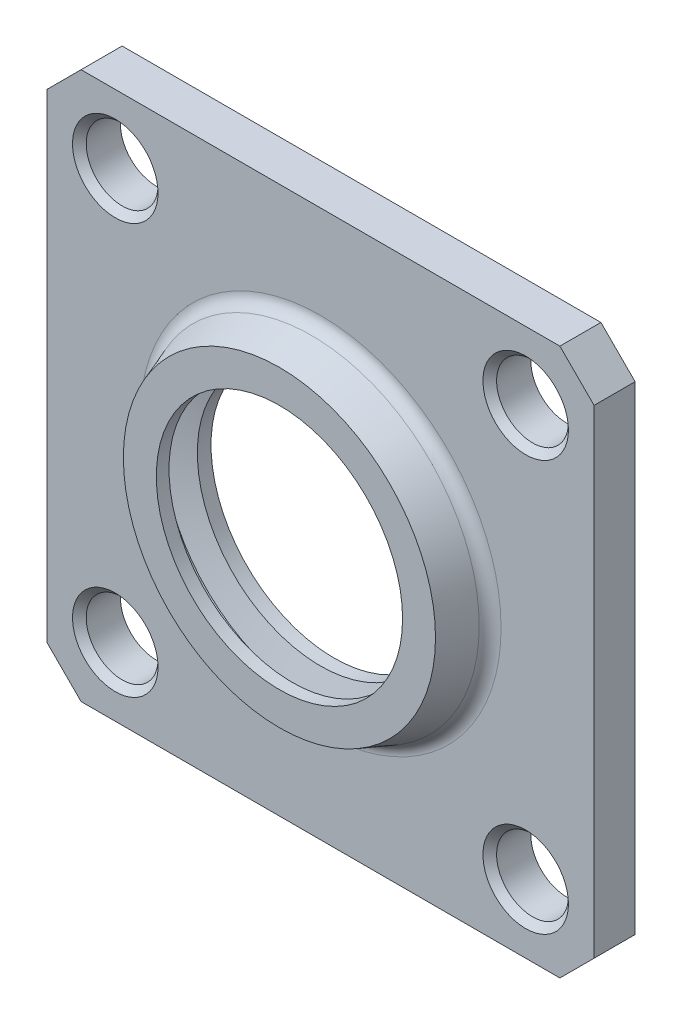
ISO-10303-21;
HEADER;
FILE_DESCRIPTION(('STEP AP214'),'2;1');
FILE_NAME('part.step','',(''),(''),'','','');
FILE_SCHEMA(('AUTOMOTIVE_DESIGN { 1 0 10303 214 1 1 1 1 }'));
ENDSEC;
DATA;
#1=APPLICATION_CONTEXT('core data for automotive mechanical design processes');
#2=APPLICATION_PROTOCOL_DEFINITION('international standard','automotive_design',2000,#1);
#3=PRODUCT_CONTEXT('',#1,'mechanical');
#4=PRODUCT('Part','Part','',(#3));
#5=PRODUCT_RELATED_PRODUCT_CATEGORY('part','',(#4));
#6=PRODUCT_DEFINITION_FORMATION('','',#4);
#7=PRODUCT_DEFINITION_CONTEXT('part definition',#1,'design');
#8=PRODUCT_DEFINITION('design','',#6,#7);
#9=PRODUCT_DEFINITION_SHAPE('','',#8);
#10=(LENGTH_UNIT() NAMED_UNIT(*) SI_UNIT(.MILLI.,.METRE.));
#11=(NAMED_UNIT(*) PLANE_ANGLE_UNIT() SI_UNIT($,.RADIAN.));
#12=(NAMED_UNIT(*) SI_UNIT($,.STERADIAN.) SOLID_ANGLE_UNIT());
#13=UNCERTAINTY_MEASURE_WITH_UNIT(LENGTH_MEASURE(1.E-05),#10,'distance_accuracy_value','');
#14=(GEOMETRIC_REPRESENTATION_CONTEXT(3) GLOBAL_UNCERTAINTY_ASSIGNED_CONTEXT((#13)) GLOBAL_UNIT_ASSIGNED_CONTEXT((#10,
#11,#12)) REPRESENTATION_CONTEXT('',''));
#15=CARTESIAN_POINT('',(0.,0.,0.));
#16=DIRECTION('',(0.,0.,1.));
#17=DIRECTION('',(1.,0.,0.));
#18=AXIS2_PLACEMENT_3D('',#15,#16,#17);
#19=CARTESIAN_POINT('',(-30.,-30.,0.959883800153095));
#20=DIRECTION('',(0.,-1.,0.));
#21=DIRECTION('',(0.,0.,-1.));
#22=AXIS2_PLACEMENT_3D('',#19,#20,#21);
#23=PLANE('',#22);
#24=DIRECTION('',(1.,0.,0.));
#25=VECTOR('',#24,1.);
#26=CARTESIAN_POINT('',(-30.,-30.,0.959883800153095));
#27=LINE('',#26,#25);
#28=CARTESIAN_POINT('',(-26.25,-30.,0.959883800153095));
#29=VERTEX_POINT('',#28);
#30=CARTESIAN_POINT('',(26.25,-30.,0.959883800153095));
#31=VERTEX_POINT('',#30);
#32=EDGE_CURVE('E300',#29,#31,#27,.T.);
#33=ORIENTED_EDGE('',*,*,#32,.T.);
#34=DIRECTION('',(0.,0.,1.));
#35=VECTOR('',#34,1.);
#36=CARTESIAN_POINT('',(26.25,-30.,0.959883800153095));
#37=LINE('',#36,#35);
#38=CARTESIAN_POINT('',(26.25,-30.,5.4598838001531));
#39=VERTEX_POINT('',#38);
#40=EDGE_CURVE('E120',#31,#39,#37,.T.);
#41=ORIENTED_EDGE('',*,*,#40,.T.);
#42=DIRECTION('',(1.,0.,0.));
#43=VECTOR('',#42,1.);
#44=CARTESIAN_POINT('',(-30.,-30.,5.4598838001531));
#45=LINE('',#44,#43);
#46=CARTESIAN_POINT('',(-26.25,-30.,5.4598838001531));
#47=VERTEX_POINT('',#46);
#48=EDGE_CURVE('E104',#47,#39,#45,.T.);
#49=ORIENTED_EDGE('',*,*,#48,.F.);
#50=DIRECTION('',(0.,0.,-1.));
#51=VECTOR('',#50,1.);
#52=CARTESIAN_POINT('',(-26.25,-30.,0.959883800153095));
#53=LINE('',#52,#51);
#54=EDGE_CURVE('E117',#47,#29,#53,.T.);
#55=ORIENTED_EDGE('',*,*,#54,.T.);
#56=EDGE_LOOP('',(#33,#41,#49,#55));
#57=FACE_BOUND('',#56,.T.);
#58=ADVANCED_FACE('F34',(#57),#23,.T.);
#59=CARTESIAN_POINT('',(-30.,30.,0.959883800153095));
#60=DIRECTION('',(-1.,0.,0.));
#61=DIRECTION('',(0.,0.,1.));
#62=AXIS2_PLACEMENT_3D('',#59,#60,#61);
#63=PLANE('',#62);
#64=DIRECTION('',(0.,-1.,0.));
#65=VECTOR('',#64,1.);
#66=CARTESIAN_POINT('',(-30.,30.,0.959883800153095));
#67=LINE('',#66,#65);
#68=CARTESIAN_POINT('',(-30.,26.25,0.959883800153095));
#69=VERTEX_POINT('',#68);
#70=CARTESIAN_POINT('',(-30.,-26.25,0.959883800153095));
#71=VERTEX_POINT('',#70);
#72=EDGE_CURVE('E127',#69,#71,#67,.T.);
#73=ORIENTED_EDGE('',*,*,#72,.T.);
#74=DIRECTION('',(0.,0.,1.));
#75=VECTOR('',#74,1.);
#76=CARTESIAN_POINT('',(-30.,-26.25,0.959883800153095));
#77=LINE('',#76,#75);
#78=CARTESIAN_POINT('',(-30.,-26.25,5.4598838001531));
#79=VERTEX_POINT('',#78);
#80=EDGE_CURVE('E153',#71,#79,#77,.T.);
#81=ORIENTED_EDGE('',*,*,#80,.T.);
#82=DIRECTION('',(0.,-1.,0.));
#83=VECTOR('',#82,1.);
#84=CARTESIAN_POINT('',(-30.,30.,5.4598838001531));
#85=LINE('',#84,#83);
#86=CARTESIAN_POINT('',(-30.,26.25,5.4598838001531));
#87=VERTEX_POINT('',#86);
#88=EDGE_CURVE('E106',#87,#79,#85,.T.);
#89=ORIENTED_EDGE('',*,*,#88,.F.);
#90=DIRECTION('',(0.,0.,-1.));
#91=VECTOR('',#90,1.);
#92=CARTESIAN_POINT('',(-30.,26.25,0.959883800153095));
#93=LINE('',#92,#91);
#94=EDGE_CURVE('E151',#87,#69,#93,.T.);
#95=ORIENTED_EDGE('',*,*,#94,.T.);
#96=EDGE_LOOP('',(#73,#81,#89,#95));
#97=FACE_BOUND('',#96,.T.);
#98=ADVANCED_FACE('F210',(#97),#63,.T.);
#99=CARTESIAN_POINT('',(30.,30.,0.959883800153095));
#100=DIRECTION('',(0.,1.,0.));
#101=DIRECTION('',(0.,0.,1.));
#102=AXIS2_PLACEMENT_3D('',#99,#100,#101);
#103=PLANE('',#102);
#104=DIRECTION('',(-1.,0.,0.));
#105=VECTOR('',#104,1.);
#106=CARTESIAN_POINT('',(30.,30.,5.4598838001531));
#107=LINE('',#106,#105);
#108=CARTESIAN_POINT('',(26.25,30.,5.4598838001531));
#109=VERTEX_POINT('',#108);
#110=CARTESIAN_POINT('',(-26.25,30.,5.4598838001531));
#111=VERTEX_POINT('',#110);
#112=EDGE_CURVE('E307',#109,#111,#107,.T.);
#113=ORIENTED_EDGE('',*,*,#112,.F.);
#114=DIRECTION('',(0.,0.,-1.));
#115=VECTOR('',#114,1.);
#116=CARTESIAN_POINT('',(26.25,30.,0.959883800153095));
#117=LINE('',#116,#115);
#118=CARTESIAN_POINT('',(26.25,30.,0.959883800153095));
#119=VERTEX_POINT('',#118);
#120=EDGE_CURVE('E56',#109,#119,#117,.T.);
#121=ORIENTED_EDGE('',*,*,#120,.T.);
#122=DIRECTION('',(-1.,0.,0.));
#123=VECTOR('',#122,1.);
#124=CARTESIAN_POINT('',(30.,30.,0.959883800153095));
#125=LINE('',#124,#123);
#126=CARTESIAN_POINT('',(-26.25,30.,0.959883800153095));
#127=VERTEX_POINT('',#126);
#128=EDGE_CURVE('E132',#119,#127,#125,.T.);
#129=ORIENTED_EDGE('',*,*,#128,.T.);
#130=DIRECTION('',(0.,0.,1.));
#131=VECTOR('',#130,1.);
#132=CARTESIAN_POINT('',(-26.25,30.,0.959883800153095));
#133=LINE('',#132,#131);
#134=EDGE_CURVE('E155',#127,#111,#133,.T.);
#135=ORIENTED_EDGE('',*,*,#134,.T.);
#136=EDGE_LOOP('',(#113,#121,#129,#135));
#137=FACE_BOUND('',#136,.T.);
#138=ADVANCED_FACE('F215',(#137),#103,.T.);
#139=CARTESIAN_POINT('',(30.,-30.,0.959883800153095));
#140=DIRECTION('',(1.,0.,0.));
#141=DIRECTION('',(0.,0.,-1.));
#142=AXIS2_PLACEMENT_3D('',#139,#140,#141);
#143=PLANE('',#142);
#144=DIRECTION('',(0.,1.,0.));
#145=VECTOR('',#144,1.);
#146=CARTESIAN_POINT('',(30.,-30.,5.4598838001531));
#147=LINE('',#146,#145);
#148=CARTESIAN_POINT('',(30.,-26.25,5.4598838001531));
#149=VERTEX_POINT('',#148);
#150=CARTESIAN_POINT('',(30.,26.25,5.4598838001531));
#151=VERTEX_POINT('',#150);
#152=EDGE_CURVE('E121',#149,#151,#147,.T.);
#153=ORIENTED_EDGE('',*,*,#152,.F.);
#154=DIRECTION('',(0.,0.,-1.));
#155=VECTOR('',#154,1.);
#156=CARTESIAN_POINT('',(30.,-26.25,0.959883800153095));
#157=LINE('',#156,#155);
#158=CARTESIAN_POINT('',(30.,-26.25,0.959883800153095));
#159=VERTEX_POINT('',#158);
#160=EDGE_CURVE('E143',#149,#159,#157,.T.);
#161=ORIENTED_EDGE('',*,*,#160,.T.);
#162=DIRECTION('',(0.,1.,0.));
#163=VECTOR('',#162,1.);
#164=CARTESIAN_POINT('',(30.,-30.,0.959883800153095));
#165=LINE('',#164,#163);
#166=CARTESIAN_POINT('',(30.,26.25,0.959883800153095));
#167=VERTEX_POINT('',#166);
#168=EDGE_CURVE('E302',#159,#167,#165,.T.);
#169=ORIENTED_EDGE('',*,*,#168,.T.);
#170=DIRECTION('',(0.,0.,1.));
#171=VECTOR('',#170,1.);
#172=CARTESIAN_POINT('',(30.,26.25,0.959883800153095));
#173=LINE('',#172,#171);
#174=EDGE_CURVE('E140',#167,#151,#173,.T.);
#175=ORIENTED_EDGE('',*,*,#174,.T.);
#176=EDGE_LOOP('',(#153,#161,#169,#175));
#177=FACE_BOUND('',#176,.T.);
#178=ADVANCED_FACE('F220',(#177),#143,.T.);
#179=CARTESIAN_POINT('',(0.,0.,0.959883800153095));
#180=DIRECTION('',(0.,0.,1.));
#181=DIRECTION('',(1.,0.,0.));
#182=AXIS2_PLACEMENT_3D('',#179,#180,#181);
#183=PLANE('',#182);
#184=CARTESIAN_POINT('',(0.,0.,0.959883800153095));
#185=DIRECTION('',(0.,0.,1.));
#186=DIRECTION('',(1.,0.,0.));
#187=AXIS2_PLACEMENT_3D('',#184,#185,#186);
#188=CIRCLE('',#187,20.2500000000295);
#189=CARTESIAN_POINT('',(20.2500000000295,0.,0.959883800153095));
#190=VERTEX_POINT('',#189);
#191=EDGE_CURVE('E177',#190,#190,#188,.T.);
#192=ORIENTED_EDGE('',*,*,#191,.T.);
#193=EDGE_LOOP('',(#192));
#194=FACE_BOUND('',#193,.T.);
#195=CARTESIAN_POINT('',(22.5,22.5,0.959883800153092));
#196=DIRECTION('',(0.,0.,1.));
#197=DIRECTION('',(1.,0.,0.));
#198=AXIS2_PLACEMENT_3D('',#195,#196,#197);
#199=CIRCLE('',#198,3.93749999999999);
#200=CARTESIAN_POINT('',(26.4375,22.5,0.959883800153092));
#201=VERTEX_POINT('',#200);
#202=EDGE_CURVE('E267',#201,#201,#199,.T.);
#203=ORIENTED_EDGE('',*,*,#202,.T.);
#204=EDGE_LOOP('',(#203));
#205=FACE_BOUND('',#204,.T.);
#206=CARTESIAN_POINT('',(-22.5,22.5,0.959883800153092));
#207=DIRECTION('',(0.,0.,1.));
#208=DIRECTION('',(1.,0.,0.));
#209=AXIS2_PLACEMENT_3D('',#206,#207,#208);
#210=CIRCLE('',#209,3.93749999999999);
#211=CARTESIAN_POINT('',(-18.5625,22.5,0.959883800153092));
#212=VERTEX_POINT('',#211);
#213=EDGE_CURVE('E269',#212,#212,#210,.T.);
#214=ORIENTED_EDGE('',*,*,#213,.T.);
#215=EDGE_LOOP('',(#214));
#216=FACE_BOUND('',#215,.T.);
#217=CARTESIAN_POINT('',(-22.5,-22.5,0.959883800153092));
#218=DIRECTION('',(0.,0.,1.));
#219=DIRECTION('',(1.,0.,0.));
#220=AXIS2_PLACEMENT_3D('',#217,#218,#219);
#221=CIRCLE('',#220,3.93749999999999);
#222=CARTESIAN_POINT('',(-18.5625,-22.5,0.959883800153092));
#223=VERTEX_POINT('',#222);
#224=EDGE_CURVE('E272',#223,#223,#221,.T.);
#225=ORIENTED_EDGE('',*,*,#224,.T.);
#226=EDGE_LOOP('',(#225));
#227=FACE_BOUND('',#226,.T.);
#228=CARTESIAN_POINT('',(22.5,-22.5,0.959883800153092));
#229=DIRECTION('',(0.,0.,1.));
#230=DIRECTION('',(1.,0.,0.));
#231=AXIS2_PLACEMENT_3D('',#228,#229,#230);
#232=CIRCLE('',#231,3.93749999999999);
#233=CARTESIAN_POINT('',(26.4375,-22.5,0.959883800153092));
#234=VERTEX_POINT('',#233);
#235=EDGE_CURVE('E277',#234,#234,#232,.T.);
#236=ORIENTED_EDGE('',*,*,#235,.T.);
#237=EDGE_LOOP('',(#236));
#238=FACE_BOUND('',#237,.T.);
#239=ORIENTED_EDGE('',*,*,#168,.F.);
#240=DIRECTION('',(0.707106781186546,0.707106781186549,0.));
#241=VECTOR('',#240,1.);
#242=CARTESIAN_POINT('',(26.25,-30.,0.959883800153095));
#243=LINE('',#242,#241);
#244=EDGE_CURVE('E149',#159,#31,#243,.F.);
#245=ORIENTED_EDGE('',*,*,#244,.T.);
#246=ORIENTED_EDGE('',*,*,#32,.F.);
#247=DIRECTION('',(0.707106781186549,-0.707106781186546,0.));
#248=VECTOR('',#247,1.);
#249=CARTESIAN_POINT('',(-30.,-26.25,0.959883800153095));
#250=LINE('',#249,#248);
#251=EDGE_CURVE('E126',#29,#71,#250,.F.);
#252=ORIENTED_EDGE('',*,*,#251,.T.);
#253=ORIENTED_EDGE('',*,*,#72,.F.);
#254=DIRECTION('',(-0.707106781186546,-0.707106781186549,0.));
#255=VECTOR('',#254,1.);
#256=CARTESIAN_POINT('',(-26.25,30.,0.959883800153095));
#257=LINE('',#256,#255);
#258=EDGE_CURVE('E49',#69,#127,#257,.F.);
#259=ORIENTED_EDGE('',*,*,#258,.T.);
#260=ORIENTED_EDGE('',*,*,#128,.F.);
#261=DIRECTION('',(-0.707106781186549,0.707106781186546,0.));
#262=VECTOR('',#261,1.);
#263=CARTESIAN_POINT('',(30.,26.25,0.959883800153095));
#264=LINE('',#263,#262);
#265=EDGE_CURVE('E146',#119,#167,#264,.F.);
#266=ORIENTED_EDGE('',*,*,#265,.T.);
#267=EDGE_LOOP('',(#239,#245,#246,#252,#253,#259,#260,#266));
#268=FACE_BOUND('',#267,.T.);
#269=ADVANCED_FACE('F313',(#194,#205,#216,#227,#238,#268),#183,.F.);
#270=CARTESIAN_POINT('',(0.,0.,5.4598838001531));
#271=DIRECTION('',(0.,0.,1.));
#272=DIRECTION('',(1.,0.,0.));
#273=AXIS2_PLACEMENT_3D('',#270,#271,#272);
#274=PLANE('',#273);
#275=CARTESIAN_POINT('',(0.,0.,5.4598838001531));
#276=DIRECTION('',(0.,0.,1.));
#277=DIRECTION('',(1.,0.,0.));
#278=AXIS2_PLACEMENT_3D('',#275,#276,#277);
#279=CIRCLE('',#278,19.8003113073173);
#280=CARTESIAN_POINT('',(19.8003113073173,0.,5.4598838001531));
#281=VERTEX_POINT('',#280);
#282=EDGE_CURVE('E11',#281,#281,#279,.F.);
#283=ORIENTED_EDGE('',*,*,#282,.T.);
#284=EDGE_LOOP('',(#283));
#285=FACE_BOUND('',#284,.T.);
#286=CARTESIAN_POINT('',(-22.5,-22.5,5.4598838001531));
#287=DIRECTION('',(0.,0.,1.));
#288=DIRECTION('',(1.,0.,0.));
#289=AXIS2_PLACEMENT_3D('',#286,#287,#288);
#290=CIRCLE('',#289,4.6875000000295);
#291=CARTESIAN_POINT('',(-17.8124999999705,-22.5,5.4598838001531));
#292=VERTEX_POINT('',#291);
#293=EDGE_CURVE('E171',#292,#292,#290,.F.);
#294=ORIENTED_EDGE('',*,*,#293,.T.);
#295=EDGE_LOOP('',(#294));
#296=FACE_BOUND('',#295,.T.);
#297=CARTESIAN_POINT('',(22.5,-22.5,5.4598838001531));
#298=DIRECTION('',(0.,0.,1.));
#299=DIRECTION('',(1.,0.,0.));
#300=AXIS2_PLACEMENT_3D('',#297,#298,#299);
#301=CIRCLE('',#300,4.6875000000295);
#302=CARTESIAN_POINT('',(27.1875000000295,-22.5,5.4598838001531));
#303=VERTEX_POINT('',#302);
#304=EDGE_CURVE('E168',#303,#303,#301,.F.);
#305=ORIENTED_EDGE('',*,*,#304,.T.);
#306=EDGE_LOOP('',(#305));
#307=FACE_BOUND('',#306,.T.);
#308=CARTESIAN_POINT('',(-22.5,22.5,5.4598838001531));
#309=DIRECTION('',(0.,0.,1.));
#310=DIRECTION('',(1.,0.,0.));
#311=AXIS2_PLACEMENT_3D('',#308,#309,#310);
#312=CIRCLE('',#311,4.6875000000295);
#313=CARTESIAN_POINT('',(-17.8124999999705,22.5,5.4598838001531));
#314=VERTEX_POINT('',#313);
#315=EDGE_CURVE('E165',#314,#314,#312,.F.);
#316=ORIENTED_EDGE('',*,*,#315,.T.);
#317=EDGE_LOOP('',(#316));
#318=FACE_BOUND('',#317,.T.);
#319=CARTESIAN_POINT('',(22.5,22.5,5.4598838001531));
#320=DIRECTION('',(0.,0.,1.));
#321=DIRECTION('',(1.,0.,0.));
#322=AXIS2_PLACEMENT_3D('',#319,#320,#321);
#323=CIRCLE('',#322,4.6875000000295);
#324=CARTESIAN_POINT('',(27.1875000000295,22.5,5.4598838001531));
#325=VERTEX_POINT('',#324);
#326=EDGE_CURVE('E162',#325,#325,#323,.F.);
#327=ORIENTED_EDGE('',*,*,#326,.T.);
#328=EDGE_LOOP('',(#327));
#329=FACE_BOUND('',#328,.T.);
#330=ORIENTED_EDGE('',*,*,#48,.T.);
#331=DIRECTION('',(-0.707106781186546,-0.707106781186549,0.));
#332=VECTOR('',#331,1.);
#333=CARTESIAN_POINT('',(28.1250000000001,-28.1249999999999,5.4598838001531));
#334=LINE('',#333,#332);
#335=EDGE_CURVE('E111',#39,#149,#334,.F.);
#336=ORIENTED_EDGE('',*,*,#335,.T.);
#337=ORIENTED_EDGE('',*,*,#152,.T.);
#338=DIRECTION('',(0.707106781186549,-0.707106781186546,0.));
#339=VECTOR('',#338,1.);
#340=CARTESIAN_POINT('',(28.1249999999999,28.1250000000001,5.4598838001531));
#341=LINE('',#340,#339);
#342=EDGE_CURVE('E112',#151,#109,#341,.F.);
#343=ORIENTED_EDGE('',*,*,#342,.T.);
#344=ORIENTED_EDGE('',*,*,#112,.T.);
#345=DIRECTION('',(0.707106781186546,0.707106781186549,0.));
#346=VECTOR('',#345,1.);
#347=CARTESIAN_POINT('',(-28.1250000000001,28.1249999999999,5.4598838001531));
#348=LINE('',#347,#346);
#349=EDGE_CURVE('E129',#111,#87,#348,.F.);
#350=ORIENTED_EDGE('',*,*,#349,.T.);
#351=ORIENTED_EDGE('',*,*,#88,.T.);
#352=DIRECTION('',(-0.707106781186549,0.707106781186546,0.));
#353=VECTOR('',#352,1.);
#354=CARTESIAN_POINT('',(-28.1249999999999,-28.1250000000001,5.4598838001531));
#355=LINE('',#354,#353);
#356=EDGE_CURVE('E101',#79,#47,#355,.F.);
#357=ORIENTED_EDGE('',*,*,#356,.T.);
#358=EDGE_LOOP('',(#330,#336,#337,#343,#344,#350,#351,#357));
#359=FACE_BOUND('',#358,.T.);
#360=ADVANCED_FACE('F103',(#285,#296,#307,#318,#329,#359),#274,.T.);
#361=CARTESIAN_POINT('',(0.,0.,9.9598838001531));
#362=DIRECTION('',(0.,0.,-1.));
#363=DIRECTION('',(-1.,0.,0.));
#364=AXIS2_PLACEMENT_3D('',#361,#362,#363);
#365=CONICAL_SURFACE('',#364,17.1121339458051,0.3490658503988);
#366=CARTESIAN_POINT('',(0.,0.,6.44685358516469));
#367=DIRECTION('',(0.,0.,-1.));
#368=DIRECTION('',(-1.,0.,0.));
#369=AXIS2_PLACEMENT_3D('',#366,#367,#368);
#370=CIRCLE('',#369,18.3907723761384);
#371=CARTESIAN_POINT('',(-18.3907723761384,0.,6.44685358516469));
#372=VERTEX_POINT('',#371);
#373=EDGE_CURVE('E42',#372,#372,#370,.F.);
#374=ORIENTED_EDGE('',*,*,#373,.T.);
#375=EDGE_LOOP('',(#374));
#376=FACE_BOUND('',#375,.T.);
#377=CARTESIAN_POINT('',(0.,0.,9.9598838001531));
#378=DIRECTION('',(0.,0.,1.));
#379=DIRECTION('',(1.,0.,0.));
#380=AXIS2_PLACEMENT_3D('',#377,#378,#379);
#381=CIRCLE('',#380,17.1121339458051);
#382=CARTESIAN_POINT('',(17.1121339458051,0.,9.9598838001531));
#383=VERTEX_POINT('',#382);
#384=EDGE_CURVE('E122',#383,#383,#381,.T.);
#385=ORIENTED_EDGE('',*,*,#384,.F.);
#386=EDGE_LOOP('',(#385));
#387=FACE_BOUND('',#386,.T.);
#388=ADVANCED_FACE('F197',(#376,#387),#365,.T.);
#389=CARTESIAN_POINT('',(0.,0.,9.9598838001531));
#390=DIRECTION('',(0.,0.,1.));
#391=DIRECTION('',(1.,0.,0.));
#392=AXIS2_PLACEMENT_3D('',#389,#390,#391);
#393=PLANE('',#392);
#394=CARTESIAN_POINT('',(0.,0.,9.9598838001531));
#395=DIRECTION('',(0.,0.,1.));
#396=DIRECTION('',(1.,0.,0.));
#397=AXIS2_PLACEMENT_3D('',#394,#395,#396);
#398=CIRCLE('',#397,13.5);
#399=CARTESIAN_POINT('',(13.5,0.,9.9598838001531));
#400=VERTEX_POINT('',#399);
#401=EDGE_CURVE('E295',#400,#400,#398,.T.);
#402=ORIENTED_EDGE('',*,*,#401,.F.);
#403=EDGE_LOOP('',(#402));
#404=FACE_BOUND('',#403,.T.);
#405=ORIENTED_EDGE('',*,*,#384,.T.);
#406=EDGE_LOOP('',(#405));
#407=FACE_BOUND('',#406,.T.);
#408=ADVANCED_FACE('F334',(#404,#407),#393,.T.);
#409=CARTESIAN_POINT('',(0.,0.,0.959883800153095));
#410=DIRECTION('',(0.,0.,1.));
#411=DIRECTION('',(1.,0.,0.));
#412=AXIS2_PLACEMENT_3D('',#409,#410,#411);
#413=CYLINDRICAL_SURFACE('',#412,19.5);
#414=CARTESIAN_POINT('',(0.,0.,3.20988380015309));
#415=DIRECTION('',(0.,0.,1.));
#416=DIRECTION('',(1.,0.,0.));
#417=AXIS2_PLACEMENT_3D('',#414,#415,#416);
#418=CIRCLE('',#417,19.5);
#419=CARTESIAN_POINT('',(19.5,0.,3.20988380015309));
#420=VERTEX_POINT('',#419);
#421=EDGE_CURVE('E189',#420,#420,#418,.T.);
#422=ORIENTED_EDGE('',*,*,#421,.T.);
#423=EDGE_LOOP('',(#422));
#424=FACE_BOUND('',#423,.T.);
#425=CARTESIAN_POINT('',(0.,0.,1.70988380018259));
#426=DIRECTION('',(0.,0.,1.));
#427=DIRECTION('',(1.,0.,0.));
#428=AXIS2_PLACEMENT_3D('',#425,#426,#427);
#429=CIRCLE('',#428,19.5);
#430=CARTESIAN_POINT('',(19.5,0.,1.70988380018259));
#431=VERTEX_POINT('',#430);
#432=EDGE_CURVE('E180',#431,#431,#429,.F.);
#433=ORIENTED_EDGE('',*,*,#432,.T.);
#434=EDGE_LOOP('',(#433));
#435=FACE_BOUND('',#434,.T.);
#436=ADVANCED_FACE('F337',(#424,#435),#413,.F.);
#437=CARTESIAN_POINT('',(0.,0.,0.959883800153095));
#438=DIRECTION('',(0.,0.,1.));
#439=DIRECTION('',(1.,0.,0.));
#440=AXIS2_PLACEMENT_3D('',#437,#438,#439);
#441=CYLINDRICAL_SURFACE('',#440,13.5);
#442=CARTESIAN_POINT('',(0.,0.,8.56757895474059));
#443=DIRECTION('',(0.,0.,1.));
#444=DIRECTION('',(1.,0.,0.));
#445=AXIS2_PLACEMENT_3D('',#442,#443,#444);
#446=CIRCLE('',#445,13.5);
#447=CARTESIAN_POINT('',(13.5,0.,8.56757895474059));
#448=VERTEX_POINT('',#447);
#449=EDGE_CURVE('E292',#448,#448,#446,.T.);
#450=ORIENTED_EDGE('',*,*,#449,.F.);
#451=EDGE_LOOP('',(#450));
#452=FACE_BOUND('',#451,.T.);
#453=ORIENTED_EDGE('',*,*,#401,.T.);
#454=EDGE_LOOP('',(#453));
#455=FACE_BOUND('',#454,.T.);
#456=ADVANCED_FACE('F341',(#452,#455),#441,.F.);
#457=CARTESIAN_POINT('',(0.,0.,8.56757895474059));
#458=DIRECTION('',(0.,0.,-1.));
#459=DIRECTION('',(-1.,0.,0.));
#460=AXIS2_PLACEMENT_3D('',#457,#458,#459);
#461=CONICAL_SURFACE('',#460,13.5,1.30899693899545);
#462=CARTESIAN_POINT('',(0.,0.,7.76373137744627));
#463=DIRECTION('',(0.,0.,1.));
#464=DIRECTION('',(1.,0.,0.));
#465=AXIS2_PLACEMENT_3D('',#462,#463,#464);
#466=CIRCLE('',#465,16.5);
#467=CARTESIAN_POINT('',(16.5,0.,7.76373137744627));
#468=VERTEX_POINT('',#467);
#469=EDGE_CURVE('E289',#468,#468,#466,.T.);
#470=ORIENTED_EDGE('',*,*,#469,.F.);
#471=EDGE_LOOP('',(#470));
#472=FACE_BOUND('',#471,.T.);
#473=ORIENTED_EDGE('',*,*,#449,.T.);
#474=EDGE_LOOP('',(#473));
#475=FACE_BOUND('',#474,.T.);
#476=ADVANCED_FACE('F345',(#472,#475),#461,.F.);
#477=CARTESIAN_POINT('',(0.,0.,0.959883800153095));
#478=DIRECTION('',(0.,0.,1.));
#479=DIRECTION('',(1.,0.,0.));
#480=AXIS2_PLACEMENT_3D('',#477,#478,#479);
#481=CYLINDRICAL_SURFACE('',#480,16.5);
#482=CARTESIAN_POINT('',(0.,0.,6.26373137744664));
#483=DIRECTION('',(0.,0.,1.));
#484=DIRECTION('',(1.,0.,0.));
#485=AXIS2_PLACEMENT_3D('',#482,#483,#484);
#486=CIRCLE('',#485,16.5);
#487=CARTESIAN_POINT('',(16.5,0.,6.26373137744664));
#488=VERTEX_POINT('',#487);
#489=EDGE_CURVE('E286',#488,#488,#486,.T.);
#490=ORIENTED_EDGE('',*,*,#489,.F.);
#491=EDGE_LOOP('',(#490));
#492=FACE_BOUND('',#491,.T.);
#493=ORIENTED_EDGE('',*,*,#469,.T.);
#494=EDGE_LOOP('',(#493));
#495=FACE_BOUND('',#494,.T.);
#496=ADVANCED_FACE('F349',(#492,#495),#481,.F.);
#497=CARTESIAN_POINT('',(0.,0.,6.26373137744664));
#498=DIRECTION('',(0.,0.,1.));
#499=DIRECTION('',(1.,0.,0.));
#500=AXIS2_PLACEMENT_3D('',#497,#498,#499);
#501=CONICAL_SURFACE('',#500,16.5,1.30899693899569);
#502=CARTESIAN_POINT('',(0.,0.,5.4598838001531));
#503=DIRECTION('',(0.,0.,1.));
#504=DIRECTION('',(1.,0.,0.));
#505=AXIS2_PLACEMENT_3D('',#502,#503,#504);
#506=CIRCLE('',#505,13.5);
#507=CARTESIAN_POINT('',(13.5,0.,5.4598838001531));
#508=VERTEX_POINT('',#507);
#509=EDGE_CURVE('E283',#508,#508,#506,.T.);
#510=ORIENTED_EDGE('',*,*,#509,.F.);
#511=EDGE_LOOP('',(#510));
#512=FACE_BOUND('',#511,.T.);
#513=ORIENTED_EDGE('',*,*,#489,.T.);
#514=EDGE_LOOP('',(#513));
#515=FACE_BOUND('',#514,.T.);
#516=ADVANCED_FACE('F353',(#512,#515),#501,.F.);
#517=CARTESIAN_POINT('',(0.,0.,0.959883800153095));
#518=DIRECTION('',(0.,0.,1.));
#519=DIRECTION('',(1.,0.,0.));
#520=AXIS2_PLACEMENT_3D('',#517,#518,#519);
#521=CYLINDRICAL_SURFACE('',#520,13.5);
#522=CARTESIAN_POINT('',(0.,0.,3.9598838001531));
#523=DIRECTION('',(0.,0.,1.));
#524=DIRECTION('',(1.,0.,0.));
#525=AXIS2_PLACEMENT_3D('',#522,#523,#524);
#526=CIRCLE('',#525,13.5);
#527=CARTESIAN_POINT('',(13.5,0.,3.9598838001531));
#528=VERTEX_POINT('',#527);
#529=EDGE_CURVE('E280',#528,#528,#526,.T.);
#530=ORIENTED_EDGE('',*,*,#529,.F.);
#531=EDGE_LOOP('',(#530));
#532=FACE_BOUND('',#531,.T.);
#533=ORIENTED_EDGE('',*,*,#509,.T.);
#534=EDGE_LOOP('',(#533));
#535=FACE_BOUND('',#534,.T.);
#536=ADVANCED_FACE('F357',(#532,#535),#521,.F.);
#537=CARTESIAN_POINT('',(13.5,0.,3.9598838001531));
#538=DIRECTION('',(0.,0.,1.));
#539=DIRECTION('',(1.,0.,0.));
#540=AXIS2_PLACEMENT_3D('',#537,#538,#539);
#541=PLANE('',#540);
#542=CARTESIAN_POINT('',(0.,0.,3.9598838001531));
#543=DIRECTION('',(0.,0.,1.));
#544=DIRECTION('',(1.,0.,0.));
#545=AXIS2_PLACEMENT_3D('',#542,#543,#544);
#546=CIRCLE('',#545,18.75);
#547=CARTESIAN_POINT('',(18.75,0.,3.9598838001531));
#548=VERTEX_POINT('',#547);
#549=EDGE_CURVE('E192',#548,#548,#546,.F.);
#550=ORIENTED_EDGE('',*,*,#549,.T.);
#551=EDGE_LOOP('',(#550));
#552=FACE_BOUND('',#551,.T.);
#553=ORIENTED_EDGE('',*,*,#529,.T.);
#554=EDGE_LOOP('',(#553));
#555=FACE_BOUND('',#554,.T.);
#556=ADVANCED_FACE('F361',(#552,#555),#541,.F.);
#557=CARTESIAN_POINT('',(22.5,-22.5,5.4598838001531));
#558=DIRECTION('',(0.,0.,1.));
#559=DIRECTION('',(1.,0.,0.));
#560=AXIS2_PLACEMENT_3D('',#557,#558,#559);
#561=CYLINDRICAL_SURFACE('',#560,3.93749999999999);
#562=CARTESIAN_POINT('',(22.5,-22.5,4.70988380012359));
#563=DIRECTION('',(0.,0.,1.));
#564=DIRECTION('',(1.,0.,0.));
#565=AXIS2_PLACEMENT_3D('',#562,#563,#564);
#566=CIRCLE('',#565,3.93749999999999);
#567=CARTESIAN_POINT('',(26.4375,-22.5,4.70988380012359));
#568=VERTEX_POINT('',#567);
#569=EDGE_CURVE('E174',#568,#568,#566,.T.);
#570=ORIENTED_EDGE('',*,*,#569,.T.);
#571=EDGE_LOOP('',(#570));
#572=FACE_BOUND('',#571,.T.);
#573=ORIENTED_EDGE('',*,*,#235,.F.);
#574=EDGE_LOOP('',(#573));
#575=FACE_BOUND('',#574,.T.);
#576=ADVANCED_FACE('F365',(#572,#575),#561,.F.);
#577=CARTESIAN_POINT('',(-22.5,-22.5,5.4598838001531));
#578=DIRECTION('',(0.,0.,1.));
#579=DIRECTION('',(1.,0.,0.));
#580=AXIS2_PLACEMENT_3D('',#577,#578,#579);
#581=CYLINDRICAL_SURFACE('',#580,3.93749999999999);
#582=CARTESIAN_POINT('',(-22.5,-22.5,4.70988380012359));
#583=DIRECTION('',(0.,0.,1.));
#584=DIRECTION('',(1.,0.,0.));
#585=AXIS2_PLACEMENT_3D('',#582,#583,#584);
#586=CIRCLE('',#585,3.93749999999999);
#587=CARTESIAN_POINT('',(-18.5625,-22.5,4.70988380012359));
#588=VERTEX_POINT('',#587);
#589=EDGE_CURVE('E159',#588,#588,#586,.T.);
#590=ORIENTED_EDGE('',*,*,#589,.T.);
#591=EDGE_LOOP('',(#590));
#592=FACE_BOUND('',#591,.T.);
#593=ORIENTED_EDGE('',*,*,#224,.F.);
#594=EDGE_LOOP('',(#593));
#595=FACE_BOUND('',#594,.T.);
#596=ADVANCED_FACE('F369',(#592,#595),#581,.F.);
#597=CARTESIAN_POINT('',(-22.5,22.5,5.4598838001531));
#598=DIRECTION('',(0.,0.,1.));
#599=DIRECTION('',(1.,0.,0.));
#600=AXIS2_PLACEMENT_3D('',#597,#598,#599);
#601=CYLINDRICAL_SURFACE('',#600,3.93749999999999);
#602=CARTESIAN_POINT('',(-22.5,22.5,4.70988380012359));
#603=DIRECTION('',(0.,0.,1.));
#604=DIRECTION('',(1.,0.,0.));
#605=AXIS2_PLACEMENT_3D('',#602,#603,#604);
#606=CIRCLE('',#605,3.93749999999999);
#607=CARTESIAN_POINT('',(-18.5625,22.5,4.70988380012359));
#608=VERTEX_POINT('',#607);
#609=EDGE_CURVE('E183',#608,#608,#606,.T.);
#610=ORIENTED_EDGE('',*,*,#609,.T.);
#611=EDGE_LOOP('',(#610));
#612=FACE_BOUND('',#611,.T.);
#613=ORIENTED_EDGE('',*,*,#213,.F.);
#614=EDGE_LOOP('',(#613));
#615=FACE_BOUND('',#614,.T.);
#616=ADVANCED_FACE('F263',(#612,#615),#601,.F.);
#617=CARTESIAN_POINT('',(22.5,22.5,5.4598838001531));
#618=DIRECTION('',(0.,0.,1.));
#619=DIRECTION('',(1.,0.,0.));
#620=AXIS2_PLACEMENT_3D('',#617,#618,#619);
#621=CYLINDRICAL_SURFACE('',#620,3.93749999999999);
#622=CARTESIAN_POINT('',(22.5,22.5,4.70988380012359));
#623=DIRECTION('',(0.,0.,1.));
#624=DIRECTION('',(1.,0.,0.));
#625=AXIS2_PLACEMENT_3D('',#622,#623,#624);
#626=CIRCLE('',#625,3.93749999999999);
#627=CARTESIAN_POINT('',(26.4375,22.5,4.70988380012359));
#628=VERTEX_POINT('',#627);
#629=EDGE_CURVE('E186',#628,#628,#626,.T.);
#630=ORIENTED_EDGE('',*,*,#629,.T.);
#631=EDGE_LOOP('',(#630));
#632=FACE_BOUND('',#631,.T.);
#633=ORIENTED_EDGE('',*,*,#202,.F.);
#634=EDGE_LOOP('',(#633));
#635=FACE_BOUND('',#634,.T.);
#636=ADVANCED_FACE('F225',(#632,#635),#621,.F.);
#637=CARTESIAN_POINT('',(26.25,-30.,0.959883800153095));
#638=DIRECTION('',(-0.707106781186549,0.707106781186545,0.));
#639=DIRECTION('',(0.,0.,1.));
#640=AXIS2_PLACEMENT_3D('',#637,#638,#639);
#641=PLANE('',#640);
#642=ORIENTED_EDGE('',*,*,#244,.F.);
#643=ORIENTED_EDGE('',*,*,#160,.F.);
#644=ORIENTED_EDGE('',*,*,#335,.F.);
#645=ORIENTED_EDGE('',*,*,#40,.F.);
#646=EDGE_LOOP('',(#642,#643,#644,#645));
#647=FACE_BOUND('',#646,.T.);
#648=ADVANCED_FACE('F222',(#647),#641,.F.);
#649=CARTESIAN_POINT('',(-30.,-26.25,0.959883800153095));
#650=DIRECTION('',(0.707106781186545,0.707106781186549,0.));
#651=DIRECTION('',(0.,0.,1.));
#652=AXIS2_PLACEMENT_3D('',#649,#650,#651);
#653=PLANE('',#652);
#654=ORIENTED_EDGE('',*,*,#251,.F.);
#655=ORIENTED_EDGE('',*,*,#54,.F.);
#656=ORIENTED_EDGE('',*,*,#356,.F.);
#657=ORIENTED_EDGE('',*,*,#80,.F.);
#658=EDGE_LOOP('',(#654,#655,#656,#657));
#659=FACE_BOUND('',#658,.T.);
#660=ADVANCED_FACE('F125',(#659),#653,.F.);
#661=CARTESIAN_POINT('',(30.,26.25,0.959883800153095));
#662=DIRECTION('',(-0.707106781186545,-0.707106781186549,0.));
#663=DIRECTION('',(0.,0.,1.));
#664=AXIS2_PLACEMENT_3D('',#661,#662,#663);
#665=PLANE('',#664);
#666=ORIENTED_EDGE('',*,*,#265,.F.);
#667=ORIENTED_EDGE('',*,*,#120,.F.);
#668=ORIENTED_EDGE('',*,*,#342,.F.);
#669=ORIENTED_EDGE('',*,*,#174,.F.);
#670=EDGE_LOOP('',(#666,#667,#668,#669));
#671=FACE_BOUND('',#670,.T.);
#672=ADVANCED_FACE('F229',(#671),#665,.F.);
#673=CARTESIAN_POINT('',(-26.25,30.,0.959883800153095));
#674=DIRECTION('',(0.707106781186549,-0.707106781186545,0.));
#675=DIRECTION('',(0.,0.,1.));
#676=AXIS2_PLACEMENT_3D('',#673,#674,#675);
#677=PLANE('',#676);
#678=ORIENTED_EDGE('',*,*,#258,.F.);
#679=ORIENTED_EDGE('',*,*,#94,.F.);
#680=ORIENTED_EDGE('',*,*,#349,.F.);
#681=ORIENTED_EDGE('',*,*,#134,.F.);
#682=EDGE_LOOP('',(#678,#679,#680,#681));
#683=FACE_BOUND('',#682,.T.);
#684=ADVANCED_FACE('F232',(#683),#677,.F.);
#685=CARTESIAN_POINT('',(-22.5,-22.5,4.70988380012359));
#686=DIRECTION('',(0.,0.,1.));
#687=DIRECTION('',(1.,0.,0.));
#688=AXIS2_PLACEMENT_3D('',#685,#686,#687);
#689=CONICAL_SURFACE('',#688,3.93749999999999,0.785398163397451);
#690=ORIENTED_EDGE('',*,*,#293,.F.);
#691=EDGE_LOOP('',(#690));
#692=FACE_BOUND('',#691,.T.);
#693=ORIENTED_EDGE('',*,*,#589,.F.);
#694=EDGE_LOOP('',(#693));
#695=FACE_BOUND('',#694,.T.);
#696=ADVANCED_FACE('F236',(#692,#695),#689,.F.);
#697=CARTESIAN_POINT('',(22.5,-22.5,4.70988380012359));
#698=DIRECTION('',(0.,0.,1.));
#699=DIRECTION('',(1.,0.,0.));
#700=AXIS2_PLACEMENT_3D('',#697,#698,#699);
#701=CONICAL_SURFACE('',#700,3.93749999999999,0.785398163397451);
#702=ORIENTED_EDGE('',*,*,#304,.F.);
#703=EDGE_LOOP('',(#702));
#704=FACE_BOUND('',#703,.T.);
#705=ORIENTED_EDGE('',*,*,#569,.F.);
#706=EDGE_LOOP('',(#705));
#707=FACE_BOUND('',#706,.T.);
#708=ADVANCED_FACE('F240',(#704,#707),#701,.F.);
#709=CARTESIAN_POINT('',(0.,0.,0.959883800153095));
#710=DIRECTION('',(0.,0.,-1.));
#711=DIRECTION('',(-1.,0.,0.));
#712=AXIS2_PLACEMENT_3D('',#709,#710,#711);
#713=CONICAL_SURFACE('',#712,20.2500000000295,0.785398163397448);
#714=ORIENTED_EDGE('',*,*,#432,.F.);
#715=EDGE_LOOP('',(#714));
#716=FACE_BOUND('',#715,.T.);
#717=ORIENTED_EDGE('',*,*,#191,.F.);
#718=EDGE_LOOP('',(#717));
#719=FACE_BOUND('',#718,.T.);
#720=ADVANCED_FACE('F244',(#716,#719),#713,.F.);
#721=CARTESIAN_POINT('',(-22.5,22.5,4.70988380012359));
#722=DIRECTION('',(0.,0.,1.));
#723=DIRECTION('',(1.,0.,0.));
#724=AXIS2_PLACEMENT_3D('',#721,#722,#723);
#725=CONICAL_SURFACE('',#724,3.93749999999999,0.785398163397451);
#726=ORIENTED_EDGE('',*,*,#315,.F.);
#727=EDGE_LOOP('',(#726));
#728=FACE_BOUND('',#727,.T.);
#729=ORIENTED_EDGE('',*,*,#609,.F.);
#730=EDGE_LOOP('',(#729));
#731=FACE_BOUND('',#730,.T.);
#732=ADVANCED_FACE('F248',(#728,#731),#725,.F.);
#733=CARTESIAN_POINT('',(22.5,22.5,4.70988380012359));
#734=DIRECTION('',(0.,0.,1.));
#735=DIRECTION('',(1.,0.,0.));
#736=AXIS2_PLACEMENT_3D('',#733,#734,#735);
#737=CONICAL_SURFACE('',#736,3.93749999999999,0.785398163397451);
#738=ORIENTED_EDGE('',*,*,#326,.F.);
#739=EDGE_LOOP('',(#738));
#740=FACE_BOUND('',#739,.T.);
#741=ORIENTED_EDGE('',*,*,#629,.F.);
#742=EDGE_LOOP('',(#741));
#743=FACE_BOUND('',#742,.T.);
#744=ADVANCED_FACE('F206',(#740,#743),#737,.F.);
#745=CARTESIAN_POINT('',(0.,0.,3.20988380015309));
#746=DIRECTION('',(0.,0.,1.));
#747=DIRECTION('',(1.,0.,0.));
#748=AXIS2_PLACEMENT_3D('',#745,#746,#747);
#749=TOROIDAL_SURFACE('',#748,18.75,0.750000000000001);
#750=ORIENTED_EDGE('',*,*,#549,.F.);
#751=EDGE_LOOP('',(#750));
#752=FACE_BOUND('',#751,.T.);
#753=ORIENTED_EDGE('',*,*,#421,.F.);
#754=EDGE_LOOP('',(#753));
#755=FACE_BOUND('',#754,.T.);
#756=ADVANCED_FACE('F201',(#752,#755),#749,.F.);
#757=CARTESIAN_POINT('',(0.,0.,6.95988380015309));
#758=DIRECTION('',(0.,0.,1.));
#759=DIRECTION('',(1.,0.,0.));
#760=AXIS2_PLACEMENT_3D('',#757,#758,#759);
#761=TOROIDAL_SURFACE('',#760,19.8003113073173,1.5);
#762=ORIENTED_EDGE('',*,*,#282,.F.);
#763=EDGE_LOOP('',(#762));
#764=FACE_BOUND('',#763,.T.);
#765=ORIENTED_EDGE('',*,*,#373,.F.);
#766=EDGE_LOOP('',(#765));
#767=FACE_BOUND('',#766,.T.);
#768=ADVANCED_FACE('F36',(#764,#767),#761,.F.);
#769=CLOSED_SHELL('',(#58,#98,#138,#178,#269,#360,#388,#408,#436,#456,#476,#496,#516,#536,#556,
#576,#596,#616,#636,#648,#660,#672,#684,#696,#708,#720,#732,#744,#756,#768));
#770=MANIFOLD_SOLID_BREP('B2',#769);
#771=ADVANCED_BREP_SHAPE_REPRESENTATION('',(#18,#770),#14);
#772=SHAPE_DEFINITION_REPRESENTATION(#9,#771);
ENDSEC;
END-ISO-10303-21;
